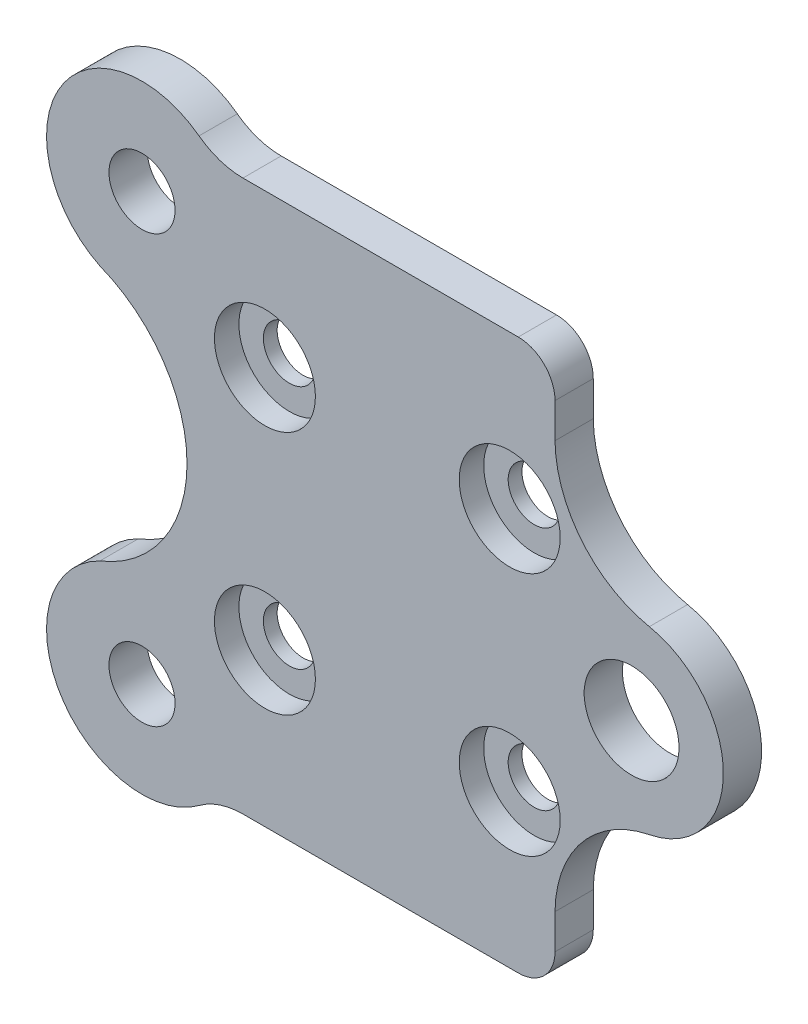
ISO-10303-21;
HEADER;
FILE_DESCRIPTION(('STEP AP214'),'2;1');
FILE_NAME('part.step','',(''),(''),'','','');
FILE_SCHEMA(('AUTOMOTIVE_DESIGN { 1 0 10303 214 1 1 1 1 }'));
ENDSEC;
DATA;
#1=APPLICATION_CONTEXT('core data for automotive mechanical design processes');
#2=APPLICATION_PROTOCOL_DEFINITION('international standard','automotive_design',2000,#1);
#3=PRODUCT_CONTEXT('',#1,'mechanical');
#4=PRODUCT('Part','Part','',(#3));
#5=PRODUCT_RELATED_PRODUCT_CATEGORY('part','',(#4));
#6=PRODUCT_DEFINITION_FORMATION('','',#4);
#7=PRODUCT_DEFINITION_CONTEXT('part definition',#1,'design');
#8=PRODUCT_DEFINITION('design','',#6,#7);
#9=PRODUCT_DEFINITION_SHAPE('','',#8);
#10=(LENGTH_UNIT() NAMED_UNIT(*) SI_UNIT(.MILLI.,.METRE.));
#11=(NAMED_UNIT(*) PLANE_ANGLE_UNIT() SI_UNIT($,.RADIAN.));
#12=(NAMED_UNIT(*) SI_UNIT($,.STERADIAN.) SOLID_ANGLE_UNIT());
#13=UNCERTAINTY_MEASURE_WITH_UNIT(LENGTH_MEASURE(1.E-05),#10,'distance_accuracy_value','');
#14=(GEOMETRIC_REPRESENTATION_CONTEXT(3) GLOBAL_UNCERTAINTY_ASSIGNED_CONTEXT((#13)) GLOBAL_UNIT_ASSIGNED_CONTEXT((#10,
#11,#12)) REPRESENTATION_CONTEXT('',''));
#15=CARTESIAN_POINT('',(0.,0.,0.));
#16=DIRECTION('',(0.,0.,1.));
#17=DIRECTION('',(1.,0.,0.));
#18=AXIS2_PLACEMENT_3D('',#15,#16,#17);
#19=CARTESIAN_POINT('',(82.0500548673,27.4305081809208,-3.125));
#20=DIRECTION('',(0.,0.,1.));
#21=DIRECTION('',(1.,0.,0.));
#22=AXIS2_PLACEMENT_3D('',#19,#20,#21);
#23=CYLINDRICAL_SURFACE('',#22,2.125);
#24=CARTESIAN_POINT('',(82.0500548673,27.4305081809208,-3.125));
#25=DIRECTION('',(0.,0.,1.));
#26=DIRECTION('',(1.,0.,0.));
#27=AXIS2_PLACEMENT_3D('',#24,#25,#26);
#28=CIRCLE('',#27,2.125);
#29=CARTESIAN_POINT('',(84.1750548673,27.4305081809208,-3.125));
#30=VERTEX_POINT('',#29);
#31=EDGE_CURVE('E620',#30,#30,#28,.T.);
#32=ORIENTED_EDGE('',*,*,#31,.F.);
#33=EDGE_LOOP('',(#32));
#34=FACE_BOUND('',#33,.T.);
#35=CARTESIAN_POINT('',(82.0500548673,27.4305081809208,-2.));
#36=DIRECTION('',(0.,0.,1.));
#37=DIRECTION('',(1.,0.,0.));
#38=AXIS2_PLACEMENT_3D('',#35,#36,#37);
#39=CIRCLE('',#38,2.125);
#40=CARTESIAN_POINT('',(84.1750548673,27.4305081809208,-2.));
#41=VERTEX_POINT('',#40);
#42=EDGE_CURVE('E441',#41,#41,#39,.F.);
#43=ORIENTED_EDGE('',*,*,#42,.F.);
#44=EDGE_LOOP('',(#43));
#45=FACE_BOUND('',#44,.T.);
#46=ADVANCED_FACE('F264',(#34,#45),#23,.F.);
#47=CARTESIAN_POINT('',(62.05010788,27.4305081809208,-3.125));
#48=DIRECTION('',(0.,0.,1.));
#49=DIRECTION('',(1.,0.,0.));
#50=AXIS2_PLACEMENT_3D('',#47,#48,#49);
#51=CYLINDRICAL_SURFACE('',#50,2.12500000000001);
#52=CARTESIAN_POINT('',(62.05010788,27.4305081809208,-3.125));
#53=DIRECTION('',(0.,0.,1.));
#54=DIRECTION('',(1.,0.,0.));
#55=AXIS2_PLACEMENT_3D('',#52,#53,#54);
#56=CIRCLE('',#55,2.12500000000001);
#57=CARTESIAN_POINT('',(64.17510788,27.4305081809208,-3.125));
#58=VERTEX_POINT('',#57);
#59=EDGE_CURVE('E623',#58,#58,#56,.T.);
#60=ORIENTED_EDGE('',*,*,#59,.F.);
#61=EDGE_LOOP('',(#60));
#62=FACE_BOUND('',#61,.T.);
#63=CARTESIAN_POINT('',(62.05010788,27.4305081809208,-2.));
#64=DIRECTION('',(0.,0.,1.));
#65=DIRECTION('',(1.,0.,0.));
#66=AXIS2_PLACEMENT_3D('',#63,#64,#65);
#67=CIRCLE('',#66,2.12500000000001);
#68=CARTESIAN_POINT('',(64.17510788,27.4305081809208,-2.));
#69=VERTEX_POINT('',#68);
#70=EDGE_CURVE('E662',#69,#69,#67,.T.);
#71=ORIENTED_EDGE('',*,*,#70,.T.);
#72=EDGE_LOOP('',(#71));
#73=FACE_BOUND('',#72,.T.);
#74=ADVANCED_FACE('F535',(#62,#73),#51,.F.);
#75=CARTESIAN_POINT('',(62.05010788,7.43050818092083,-3.125));
#76=DIRECTION('',(0.,0.,1.));
#77=DIRECTION('',(1.,0.,0.));
#78=AXIS2_PLACEMENT_3D('',#75,#76,#77);
#79=CYLINDRICAL_SURFACE('',#78,2.125);
#80=CARTESIAN_POINT('',(62.05010788,7.43050818092083,-3.125));
#81=DIRECTION('',(0.,0.,1.));
#82=DIRECTION('',(1.,0.,0.));
#83=AXIS2_PLACEMENT_3D('',#80,#81,#82);
#84=CIRCLE('',#83,2.125);
#85=CARTESIAN_POINT('',(64.17510788,7.43050818092083,-3.125));
#86=VERTEX_POINT('',#85);
#87=EDGE_CURVE('E608',#86,#86,#84,.T.);
#88=ORIENTED_EDGE('',*,*,#87,.F.);
#89=EDGE_LOOP('',(#88));
#90=FACE_BOUND('',#89,.T.);
#91=CARTESIAN_POINT('',(62.05010788,7.43050818092083,-2.));
#92=DIRECTION('',(0.,0.,1.));
#93=DIRECTION('',(1.,0.,0.));
#94=AXIS2_PLACEMENT_3D('',#91,#92,#93);
#95=CIRCLE('',#94,2.125);
#96=CARTESIAN_POINT('',(64.17510788,7.43050818092083,-2.));
#97=VERTEX_POINT('',#96);
#98=EDGE_CURVE('E614',#97,#97,#95,.T.);
#99=ORIENTED_EDGE('',*,*,#98,.T.);
#100=EDGE_LOOP('',(#99));
#101=FACE_BOUND('',#100,.T.);
#102=ADVANCED_FACE('F541',(#90,#101),#79,.F.);
#103=CARTESIAN_POINT('',(82.0500548673,7.43050818092083,-3.125));
#104=DIRECTION('',(0.,0.,1.));
#105=DIRECTION('',(1.,0.,0.));
#106=AXIS2_PLACEMENT_3D('',#103,#104,#105);
#107=CYLINDRICAL_SURFACE('',#106,2.125);
#108=CARTESIAN_POINT('',(82.0500548673,7.43050818092083,-3.125));
#109=DIRECTION('',(0.,0.,1.));
#110=DIRECTION('',(1.,0.,0.));
#111=AXIS2_PLACEMENT_3D('',#108,#109,#110);
#112=CIRCLE('',#111,2.125);
#113=CARTESIAN_POINT('',(84.1750548673,7.43050818092083,-3.125));
#114=VERTEX_POINT('',#113);
#115=EDGE_CURVE('E599',#114,#114,#112,.T.);
#116=ORIENTED_EDGE('',*,*,#115,.F.);
#117=EDGE_LOOP('',(#116));
#118=FACE_BOUND('',#117,.T.);
#119=CARTESIAN_POINT('',(82.0500548673,7.43050818092083,-2.));
#120=DIRECTION('',(0.,0.,1.));
#121=DIRECTION('',(1.,0.,0.));
#122=AXIS2_PLACEMENT_3D('',#119,#120,#121);
#123=CIRCLE('',#122,2.125);
#124=CARTESIAN_POINT('',(84.1750548673,7.43050818092083,-2.));
#125=VERTEX_POINT('',#124);
#126=EDGE_CURVE('E602',#125,#125,#123,.T.);
#127=ORIENTED_EDGE('',*,*,#126,.T.);
#128=EDGE_LOOP('',(#127));
#129=FACE_BOUND('',#128,.T.);
#130=ADVANCED_FACE('F547',(#118,#129),#107,.F.);
#131=CARTESIAN_POINT('',(52.0082075214231,-0.00478709079274138,-3.125));
#132=DIRECTION('',(0.,0.,1.));
#133=DIRECTION('',(1.,0.,0.));
#134=AXIS2_PLACEMENT_3D('',#131,#132,#133);
#135=CYLINDRICAL_SURFACE('',#134,7.80000000000975);
#136=CARTESIAN_POINT('',(52.0082075214231,-0.00478709079274138,-3.125));
#137=DIRECTION('',(0.,0.,1.));
#138=DIRECTION('',(1.,0.,0.));
#139=AXIS2_PLACEMENT_3D('',#136,#137,#138);
#140=CIRCLE('',#139,7.80000000000975);
#141=CARTESIAN_POINT('',(48.5735901579423,6.99831247772894,-3.125));
#142=VERTEX_POINT('',#141);
#143=CARTESIAN_POINT('',(56.6695313692701,-6.25875063287107,-3.125));
#144=VERTEX_POINT('',#143);
#145=EDGE_CURVE('E391',#142,#144,#140,.T.);
#146=ORIENTED_EDGE('',*,*,#145,.T.);
#147=DIRECTION('',(0.,0.,1.));
#148=VECTOR('',#147,1.);
#149=CARTESIAN_POINT('',(56.6695313692701,-6.25875063287107,-3.125));
#150=LINE('',#149,#148);
#151=CARTESIAN_POINT('',(56.6695313692701,-6.25875063287107,0.));
#152=VERTEX_POINT('',#151);
#153=EDGE_CURVE('E469',#144,#152,#150,.T.);
#154=ORIENTED_EDGE('',*,*,#153,.T.);
#155=CARTESIAN_POINT('',(52.0082075214231,-0.00478709079274138,0.));
#156=DIRECTION('',(0.,0.,1.));
#157=DIRECTION('',(1.,0.,0.));
#158=AXIS2_PLACEMENT_3D('',#155,#156,#157);
#159=CIRCLE('',#158,7.80000000000975);
#160=CARTESIAN_POINT('',(48.5735901579423,6.99831247772894,0.));
#161=VERTEX_POINT('',#160);
#162=EDGE_CURVE('E406',#161,#152,#159,.T.);
#163=ORIENTED_EDGE('',*,*,#162,.F.);
#164=DIRECTION('',(0.,0.,1.));
#165=VECTOR('',#164,1.);
#166=CARTESIAN_POINT('',(48.5735901579423,6.99831247772894,-3.125));
#167=LINE('',#166,#165);
#168=EDGE_CURVE('E429',#142,#161,#167,.T.);
#169=ORIENTED_EDGE('',*,*,#168,.F.);
#170=EDGE_LOOP('',(#146,#154,#163,#169));
#171=FACE_BOUND('',#170,.T.);
#172=ADVANCED_FACE('F501',(#171),#135,.T.);
#173=CARTESIAN_POINT('',(44.4800195239708,17.4305081809208,-3.125));
#174=DIRECTION('',(0.,0.,1.));
#175=DIRECTION('',(1.,0.,0.));
#176=AXIS2_PLACEMENT_3D('',#173,#174,#175);
#177=CYLINDRICAL_SURFACE('',#176,11.2066064321457);
#178=CARTESIAN_POINT('',(44.4800195239708,17.4305081809208,0.));
#179=DIRECTION('',(0.,0.,1.));
#180=DIRECTION('',(1.,0.,0.));
#181=AXIS2_PLACEMENT_3D('',#178,#179,#180);
#182=CIRCLE('',#181,11.2066064321457);
#183=CARTESIAN_POINT('',(48.5735901579423,27.8627038841127,0.));
#184=VERTEX_POINT('',#183);
#185=EDGE_CURVE('E427',#161,#184,#182,.T.);
#186=ORIENTED_EDGE('',*,*,#185,.T.);
#187=DIRECTION('',(0.,0.,1.));
#188=VECTOR('',#187,1.);
#189=CARTESIAN_POINT('',(48.5735901579423,27.8627038841127,-3.125));
#190=LINE('',#189,#188);
#191=CARTESIAN_POINT('',(48.5735901579423,27.8627038841127,-3.125));
#192=VERTEX_POINT('',#191);
#193=EDGE_CURVE('E432',#192,#184,#190,.T.);
#194=ORIENTED_EDGE('',*,*,#193,.F.);
#195=CARTESIAN_POINT('',(44.4800195239708,17.4305081809208,-3.125));
#196=DIRECTION('',(0.,0.,1.));
#197=DIRECTION('',(1.,0.,0.));
#198=AXIS2_PLACEMENT_3D('',#195,#196,#197);
#199=CIRCLE('',#198,11.2066064321457);
#200=EDGE_CURVE('E384',#142,#192,#199,.T.);
#201=ORIENTED_EDGE('',*,*,#200,.F.);
#202=ORIENTED_EDGE('',*,*,#168,.T.);
#203=EDGE_LOOP('',(#186,#194,#201,#202));
#204=FACE_BOUND('',#203,.T.);
#205=ADVANCED_FACE('F496',(#204),#177,.F.);
#206=CARTESIAN_POINT('',(52.0082075214231,34.8658034526344,-3.125));
#207=DIRECTION('',(0.,0.,1.));
#208=DIRECTION('',(1.,0.,0.));
#209=AXIS2_PLACEMENT_3D('',#206,#207,#208);
#210=CYLINDRICAL_SURFACE('',#209,7.80000000000975);
#211=CARTESIAN_POINT('',(52.0082075214231,34.8658034526344,0.));
#212=DIRECTION('',(0.,0.,-1.));
#213=DIRECTION('',(-1.,0.,0.));
#214=AXIS2_PLACEMENT_3D('',#211,#212,#213);
#215=CIRCLE('',#214,7.80000000000975);
#216=CARTESIAN_POINT('',(56.6695313692701,41.1197669947127,0.));
#217=VERTEX_POINT('',#216);
#218=EDGE_CURVE('E424',#184,#217,#215,.T.);
#219=ORIENTED_EDGE('',*,*,#218,.T.);
#220=DIRECTION('',(0.,0.,1.));
#221=VECTOR('',#220,1.);
#222=CARTESIAN_POINT('',(56.6695313692701,41.1197669947127,-3.125));
#223=LINE('',#222,#221);
#224=CARTESIAN_POINT('',(56.6695313692701,41.1197669947127,-3.125));
#225=VERTEX_POINT('',#224);
#226=EDGE_CURVE('E467',#217,#225,#223,.F.);
#227=ORIENTED_EDGE('',*,*,#226,.T.);
#228=CARTESIAN_POINT('',(52.0082075214231,34.8658034526344,-3.125));
#229=DIRECTION('',(0.,0.,-1.));
#230=DIRECTION('',(-1.,0.,0.));
#231=AXIS2_PLACEMENT_3D('',#228,#229,#230);
#232=CIRCLE('',#231,7.80000000000975);
#233=EDGE_CURVE('E402',#192,#225,#232,.T.);
#234=ORIENTED_EDGE('',*,*,#233,.F.);
#235=ORIENTED_EDGE('',*,*,#193,.T.);
#236=EDGE_LOOP('',(#219,#227,#234,#235));
#237=FACE_BOUND('',#236,.T.);
#238=ADVANCED_FACE('F492',(#237),#210,.T.);
#239=CARTESIAN_POINT('',(57.940219491693,39.9305081809208,-3.125));
#240=DIRECTION('',(0.,-1.,0.));
#241=DIRECTION('',(0.,0.,-1.));
#242=AXIS2_PLACEMENT_3D('',#239,#240,#241);
#243=PLANE('',#242);
#244=DIRECTION('',(1.,0.,0.));
#245=VECTOR('',#244,1.);
#246=CARTESIAN_POINT('',(57.940219491693,39.9305081809208,-3.125));
#247=LINE('',#246,#245);
#248=CARTESIAN_POINT('',(60.2551650983787,39.9305081809208,-3.125));
#249=VERTEX_POINT('',#248);
#250=CARTESIAN_POINT('',(82.7511654582989,39.9305081809208,-3.125));
#251=VERTEX_POINT('',#250);
#252=EDGE_CURVE('E400',#249,#251,#247,.T.);
#253=ORIENTED_EDGE('',*,*,#252,.F.);
#254=DIRECTION('',(0.,0.,-1.));
#255=VECTOR('',#254,1.);
#256=CARTESIAN_POINT('',(60.2551650983787,39.9305081809208,0.));
#257=LINE('',#256,#255);
#258=CARTESIAN_POINT('',(60.2551650983787,39.9305081809208,0.));
#259=VERTEX_POINT('',#258);
#260=EDGE_CURVE('E464',#249,#259,#257,.F.);
#261=ORIENTED_EDGE('',*,*,#260,.T.);
#262=DIRECTION('',(1.,0.,0.));
#263=VECTOR('',#262,1.);
#264=CARTESIAN_POINT('',(57.940219491693,39.9305081809208,0.));
#265=LINE('',#264,#263);
#266=CARTESIAN_POINT('',(82.7511654582989,39.9305081809208,0.));
#267=VERTEX_POINT('',#266);
#268=EDGE_CURVE('E422',#259,#267,#265,.T.);
#269=ORIENTED_EDGE('',*,*,#268,.T.);
#270=DIRECTION('',(0.,0.,1.));
#271=VECTOR('',#270,1.);
#272=CARTESIAN_POINT('',(82.7511654582989,39.9305081809208,-3.125));
#273=LINE('',#272,#271);
#274=EDGE_CURVE('E461',#267,#251,#273,.F.);
#275=ORIENTED_EDGE('',*,*,#274,.T.);
#276=EDGE_LOOP('',(#253,#261,#269,#275));
#277=FACE_BOUND('',#276,.T.);
#278=ADVANCED_FACE('F483',(#277),#243,.F.);
#279=CARTESIAN_POINT('',(85.7511654582989,39.9305081809208,-3.125));
#280=DIRECTION('',(-1.,0.,0.));
#281=DIRECTION('',(0.,-1.,0.));
#282=AXIS2_PLACEMENT_3D('',#279,#280,#281);
#283=PLANE('',#282);
#284=DIRECTION('',(0.,-1.,0.));
#285=VECTOR('',#284,1.);
#286=CARTESIAN_POINT('',(85.7511654582989,39.9305081809208,-3.125));
#287=LINE('',#286,#285);
#288=CARTESIAN_POINT('',(85.7511654582989,36.9305081809208,-3.125));
#289=VERTEX_POINT('',#288);
#290=CARTESIAN_POINT('',(85.7511654582988,34.0911124146329,-3.125));
#291=VERTEX_POINT('',#290);
#292=EDGE_CURVE('E398',#289,#291,#287,.T.);
#293=ORIENTED_EDGE('',*,*,#292,.F.);
#294=DIRECTION('',(0.,0.,1.));
#295=VECTOR('',#294,1.);
#296=CARTESIAN_POINT('',(85.7511654582989,36.9305081809208,-3.125));
#297=LINE('',#296,#295);
#298=CARTESIAN_POINT('',(85.7511654582989,36.9305081809208,0.));
#299=VERTEX_POINT('',#298);
#300=EDGE_CURVE('E458',#289,#299,#297,.T.);
#301=ORIENTED_EDGE('',*,*,#300,.T.);
#302=DIRECTION('',(0.,-1.,0.));
#303=VECTOR('',#302,1.);
#304=CARTESIAN_POINT('',(85.7511654582989,39.9305081809208,0.));
#305=LINE('',#304,#303);
#306=CARTESIAN_POINT('',(85.7511654582988,34.0911124146329,0.));
#307=VERTEX_POINT('',#306);
#308=EDGE_CURVE('E420',#299,#307,#305,.T.);
#309=ORIENTED_EDGE('',*,*,#308,.T.);
#310=DIRECTION('',(0.,0.,1.));
#311=VECTOR('',#310,1.);
#312=CARTESIAN_POINT('',(85.7511654582988,34.0911124146329,-3.125));
#313=LINE('',#312,#311);
#314=EDGE_CURVE('E435',#291,#307,#313,.T.);
#315=ORIENTED_EDGE('',*,*,#314,.F.);
#316=EDGE_LOOP('',(#293,#301,#309,#315));
#317=FACE_BOUND('',#316,.T.);
#318=ADVANCED_FACE('F522',(#317),#283,.F.);
#319=CARTESIAN_POINT('',(95.3555620860846,34.2048076301968,-3.125));
#320=DIRECTION('',(0.,0.,1.));
#321=DIRECTION('',(1.,0.,0.));
#322=AXIS2_PLACEMENT_3D('',#319,#320,#321);
#323=CYLINDRICAL_SURFACE('',#322,9.60506955653446);
#324=CARTESIAN_POINT('',(95.3555620860846,34.2048076301968,0.));
#325=DIRECTION('',(0.,0.,1.));
#326=DIRECTION('',(1.,0.,0.));
#327=AXIS2_PLACEMENT_3D('',#324,#325,#326);
#328=CIRCLE('',#327,9.60506955653446);
#329=CARTESIAN_POINT('',(93.4574363423077,24.7891568376772,0.));
#330=VERTEX_POINT('',#329);
#331=EDGE_CURVE('E417',#307,#330,#328,.T.);
#332=ORIENTED_EDGE('',*,*,#331,.T.);
#333=DIRECTION('',(0.,0.,1.));
#334=VECTOR('',#333,1.);
#335=CARTESIAN_POINT('',(93.4574363423077,24.7891568376772,-3.125));
#336=LINE('',#335,#334);
#337=CARTESIAN_POINT('',(93.4574363423077,24.7891568376772,-3.125));
#338=VERTEX_POINT('',#337);
#339=EDGE_CURVE('E438',#338,#330,#336,.T.);
#340=ORIENTED_EDGE('',*,*,#339,.F.);
#341=CARTESIAN_POINT('',(95.3555620860846,34.2048076301968,-3.125));
#342=DIRECTION('',(0.,0.,1.));
#343=DIRECTION('',(1.,0.,0.));
#344=AXIS2_PLACEMENT_3D('',#341,#342,#343);
#345=CIRCLE('',#344,9.60506955653446);
#346=EDGE_CURVE('E396',#291,#338,#345,.T.);
#347=ORIENTED_EDGE('',*,*,#346,.F.);
#348=ORIENTED_EDGE('',*,*,#314,.T.);
#349=EDGE_LOOP('',(#332,#340,#347,#348));
#350=FACE_BOUND('',#349,.T.);
#351=ADVANCED_FACE('F517',(#350),#323,.F.);
#352=CARTESIAN_POINT('',(92.0081986301231,17.4305081809208,-3.125));
#353=DIRECTION('',(0.,0.,1.));
#354=DIRECTION('',(1.,0.,0.));
#355=AXIS2_PLACEMENT_3D('',#352,#353,#354);
#356=CYLINDRICAL_SURFACE('',#355,7.49999999999999);
#357=CARTESIAN_POINT('',(92.0081986301231,17.4305081809208,0.));
#358=DIRECTION('',(0.,0.,1.));
#359=DIRECTION('',(1.,0.,0.));
#360=AXIS2_PLACEMENT_3D('',#357,#358,#359);
#361=CIRCLE('',#360,7.49999999999999);
#362=CARTESIAN_POINT('',(93.4574363423077,10.0718595241645,0.));
#363=VERTEX_POINT('',#362);
#364=EDGE_CURVE('E414',#363,#330,#361,.T.);
#365=ORIENTED_EDGE('',*,*,#364,.F.);
#366=DIRECTION('',(0.,0.,1.));
#367=VECTOR('',#366,1.);
#368=CARTESIAN_POINT('',(93.4574363423077,10.0718595241645,-3.125));
#369=LINE('',#368,#367);
#370=CARTESIAN_POINT('',(93.4574363423077,10.0718595241645,-3.125));
#371=VERTEX_POINT('',#370);
#372=EDGE_CURVE('E383',#371,#363,#369,.T.);
#373=ORIENTED_EDGE('',*,*,#372,.F.);
#374=CARTESIAN_POINT('',(92.0081986301231,17.4305081809208,-3.125));
#375=DIRECTION('',(0.,0.,1.));
#376=DIRECTION('',(1.,0.,0.));
#377=AXIS2_PLACEMENT_3D('',#374,#375,#376);
#378=CIRCLE('',#377,7.49999999999999);
#379=EDGE_CURVE('E372',#371,#338,#378,.T.);
#380=ORIENTED_EDGE('',*,*,#379,.T.);
#381=ORIENTED_EDGE('',*,*,#339,.T.);
#382=EDGE_LOOP('',(#365,#373,#380,#381));
#383=FACE_BOUND('',#382,.T.);
#384=ADVANCED_FACE('F513',(#383),#356,.T.);
#385=CARTESIAN_POINT('',(95.3555620860846,0.656208731644823,-3.125));
#386=DIRECTION('',(0.,0.,1.));
#387=DIRECTION('',(1.,0.,0.));
#388=AXIS2_PLACEMENT_3D('',#385,#386,#387);
#389=CYLINDRICAL_SURFACE('',#388,9.60506955653445);
#390=CARTESIAN_POINT('',(95.3555620860846,0.656208731644823,0.));
#391=DIRECTION('',(0.,0.,1.));
#392=DIRECTION('',(1.,0.,0.));
#393=AXIS2_PLACEMENT_3D('',#390,#391,#392);
#394=CIRCLE('',#393,9.60506955653445);
#395=CARTESIAN_POINT('',(85.7511654582988,0.769903947208809,0.));
#396=VERTEX_POINT('',#395);
#397=EDGE_CURVE('E379',#363,#396,#394,.T.);
#398=ORIENTED_EDGE('',*,*,#397,.T.);
#399=DIRECTION('',(0.,0.,1.));
#400=VECTOR('',#399,1.);
#401=CARTESIAN_POINT('',(85.7511654582988,0.769903947208809,-3.125));
#402=LINE('',#401,#400);
#403=CARTESIAN_POINT('',(85.7511654582988,0.769903947208809,-3.125));
#404=VERTEX_POINT('',#403);
#405=EDGE_CURVE('E376',#404,#396,#402,.T.);
#406=ORIENTED_EDGE('',*,*,#405,.F.);
#407=CARTESIAN_POINT('',(95.3555620860846,0.656208731644823,-3.125));
#408=DIRECTION('',(0.,0.,1.));
#409=DIRECTION('',(1.,0.,0.));
#410=AXIS2_PLACEMENT_3D('',#407,#408,#409);
#411=CIRCLE('',#410,9.60506955653445);
#412=EDGE_CURVE('E364',#371,#404,#411,.T.);
#413=ORIENTED_EDGE('',*,*,#412,.F.);
#414=ORIENTED_EDGE('',*,*,#372,.T.);
#415=EDGE_LOOP('',(#398,#406,#413,#414));
#416=FACE_BOUND('',#415,.T.);
#417=ADVANCED_FACE('F377',(#416),#389,.F.);
#418=CARTESIAN_POINT('',(85.7511654582988,0.769903947208809,-3.125));
#419=DIRECTION('',(-1.,0.,0.));
#420=DIRECTION('',(0.,-1.,0.));
#421=AXIS2_PLACEMENT_3D('',#418,#419,#420);
#422=PLANE('',#421);
#423=DIRECTION('',(0.,-1.,0.));
#424=VECTOR('',#423,1.);
#425=CARTESIAN_POINT('',(85.7511654582988,0.769903947208809,0.));
#426=LINE('',#425,#424);
#427=CARTESIAN_POINT('',(85.7511654582989,-2.06949181907912,0.));
#428=VERTEX_POINT('',#427);
#429=EDGE_CURVE('E411',#396,#428,#426,.T.);
#430=ORIENTED_EDGE('',*,*,#429,.T.);
#431=DIRECTION('',(0.,0.,1.));
#432=VECTOR('',#431,1.);
#433=CARTESIAN_POINT('',(85.7511654582989,-2.06949181907912,-3.125));
#434=LINE('',#433,#432);
#435=CARTESIAN_POINT('',(85.7511654582989,-2.06949181907912,-3.125));
#436=VERTEX_POINT('',#435);
#437=EDGE_CURVE('E388',#428,#436,#434,.F.);
#438=ORIENTED_EDGE('',*,*,#437,.T.);
#439=DIRECTION('',(0.,-1.,0.));
#440=VECTOR('',#439,1.);
#441=CARTESIAN_POINT('',(85.7511654582988,0.769903947208809,-3.125));
#442=LINE('',#441,#440);
#443=EDGE_CURVE('E369',#404,#436,#442,.T.);
#444=ORIENTED_EDGE('',*,*,#443,.F.);
#445=ORIENTED_EDGE('',*,*,#405,.T.);
#446=EDGE_LOOP('',(#430,#438,#444,#445));
#447=FACE_BOUND('',#446,.T.);
#448=ADVANCED_FACE('F386',(#447),#422,.F.);
#449=CARTESIAN_POINT('',(57.940219491693,-5.06949181907916,-3.125));
#450=DIRECTION('',(0.,-1.,0.));
#451=DIRECTION('',(1.,0.,0.));
#452=AXIS2_PLACEMENT_3D('',#449,#450,#451);
#453=PLANE('',#452);
#454=DIRECTION('',(1.,0.,0.));
#455=VECTOR('',#454,1.);
#456=CARTESIAN_POINT('',(57.940219491693,-5.06949181907916,0.));
#457=LINE('',#456,#455);
#458=CARTESIAN_POINT('',(60.2551650983787,-5.06949181907916,0.));
#459=VERTEX_POINT('',#458);
#460=CARTESIAN_POINT('',(82.7511654582989,-5.06949181907915,0.));
#461=VERTEX_POINT('',#460);
#462=EDGE_CURVE('E408',#459,#461,#457,.T.);
#463=ORIENTED_EDGE('',*,*,#462,.F.);
#464=DIRECTION('',(0.,0.,-1.));
#465=VECTOR('',#464,1.);
#466=CARTESIAN_POINT('',(60.2551650983787,-5.06949181907916,-3.125));
#467=LINE('',#466,#465);
#468=CARTESIAN_POINT('',(60.2551650983787,-5.06949181907916,-3.125));
#469=VERTEX_POINT('',#468);
#470=EDGE_CURVE('E285',#459,#469,#467,.T.);
#471=ORIENTED_EDGE('',*,*,#470,.T.);
#472=DIRECTION('',(1.,0.,0.));
#473=VECTOR('',#472,1.);
#474=CARTESIAN_POINT('',(57.940219491693,-5.06949181907916,-3.125));
#475=LINE('',#474,#473);
#476=CARTESIAN_POINT('',(82.7511654582989,-5.06949181907915,-3.125));
#477=VERTEX_POINT('',#476);
#478=EDGE_CURVE('E389',#469,#477,#475,.T.);
#479=ORIENTED_EDGE('',*,*,#478,.T.);
#480=DIRECTION('',(0.,0.,1.));
#481=VECTOR('',#480,1.);
#482=CARTESIAN_POINT('',(82.7511654582989,-5.06949181907915,0.));
#483=LINE('',#482,#481);
#484=EDGE_CURVE('E431',#477,#461,#483,.T.);
#485=ORIENTED_EDGE('',*,*,#484,.T.);
#486=EDGE_LOOP('',(#463,#471,#479,#485));
#487=FACE_BOUND('',#486,.T.);
#488=ADVANCED_FACE('F506',(#487),#453,.T.);
#489=CARTESIAN_POINT('',(52.0082075214231,-0.00478709079274138,-3.125));
#490=DIRECTION('',(0.,0.,1.));
#491=DIRECTION('',(1.,0.,0.));
#492=AXIS2_PLACEMENT_3D('',#489,#490,#491);
#493=PLANE('',#492);
#494=ORIENTED_EDGE('',*,*,#87,.T.);
#495=EDGE_LOOP('',(#494));
#496=FACE_BOUND('',#495,.T.);
#497=ORIENTED_EDGE('',*,*,#115,.T.);
#498=EDGE_LOOP('',(#497));
#499=FACE_BOUND('',#498,.T.);
#500=ORIENTED_EDGE('',*,*,#31,.T.);
#501=EDGE_LOOP('',(#500));
#502=FACE_BOUND('',#501,.T.);
#503=ORIENTED_EDGE('',*,*,#59,.T.);
#504=EDGE_LOOP('',(#503));
#505=FACE_BOUND('',#504,.T.);
#506=CARTESIAN_POINT('',(92.0081986301231,17.4305081809208,-3.125));
#507=DIRECTION('',(0.,0.,1.));
#508=DIRECTION('',(1.,0.,0.));
#509=AXIS2_PLACEMENT_3D('',#506,#507,#508);
#510=CIRCLE('',#509,3.875);
#511=CARTESIAN_POINT('',(95.8831986301231,17.4305081809208,-3.125));
#512=VERTEX_POINT('',#511);
#513=EDGE_CURVE('E627',#512,#512,#510,.T.);
#514=ORIENTED_EDGE('',*,*,#513,.T.);
#515=EDGE_LOOP('',(#514));
#516=FACE_BOUND('',#515,.T.);
#517=CARTESIAN_POINT('',(52.0082075214231,-0.00478709079274138,-3.125));
#518=DIRECTION('',(0.,0.,1.));
#519=DIRECTION('',(1.,0.,0.));
#520=AXIS2_PLACEMENT_3D('',#517,#518,#519);
#521=CIRCLE('',#520,2.7);
#522=CARTESIAN_POINT('',(54.7082075214231,-0.00478709079274138,-3.125));
#523=VERTEX_POINT('',#522);
#524=EDGE_CURVE('E633',#523,#523,#521,.T.);
#525=ORIENTED_EDGE('',*,*,#524,.T.);
#526=EDGE_LOOP('',(#525));
#527=FACE_BOUND('',#526,.T.);
#528=CARTESIAN_POINT('',(52.0082075214231,34.8658034526344,-3.125));
#529=DIRECTION('',(0.,0.,1.));
#530=DIRECTION('',(1.,0.,0.));
#531=AXIS2_PLACEMENT_3D('',#528,#529,#530);
#532=CIRCLE('',#531,2.70000000000001);
#533=CARTESIAN_POINT('',(54.7082075214231,34.8658034526344,-3.125));
#534=VERTEX_POINT('',#533);
#535=EDGE_CURVE('E409',#534,#534,#532,.T.);
#536=ORIENTED_EDGE('',*,*,#535,.T.);
#537=EDGE_LOOP('',(#536));
#538=FACE_BOUND('',#537,.T.);
#539=ORIENTED_EDGE('',*,*,#443,.T.);
#540=CARTESIAN_POINT('',(82.7511654582989,-2.06949181907915,-3.125));
#541=DIRECTION('',(0.,0.,1.));
#542=DIRECTION('',(1.,0.,0.));
#543=AXIS2_PLACEMENT_3D('',#540,#541,#542);
#544=CIRCLE('',#543,3.);
#545=EDGE_CURVE('E456',#436,#477,#544,.F.);
#546=ORIENTED_EDGE('',*,*,#545,.T.);
#547=ORIENTED_EDGE('',*,*,#478,.F.);
#548=CARTESIAN_POINT('',(60.2551650983787,-11.0694918190792,-3.125));
#549=DIRECTION('',(0.,0.,1.));
#550=DIRECTION('',(1.,0.,0.));
#551=AXIS2_PLACEMENT_3D('',#548,#549,#550);
#552=CIRCLE('',#551,6.);
#553=EDGE_CURVE('E12',#469,#144,#552,.T.);
#554=ORIENTED_EDGE('',*,*,#553,.T.);
#555=ORIENTED_EDGE('',*,*,#145,.F.);
#556=ORIENTED_EDGE('',*,*,#200,.T.);
#557=ORIENTED_EDGE('',*,*,#233,.T.);
#558=CARTESIAN_POINT('',(60.2551650983787,45.9305081809208,-3.125));
#559=DIRECTION('',(0.,0.,1.));
#560=DIRECTION('',(1.,0.,0.));
#561=AXIS2_PLACEMENT_3D('',#558,#559,#560);
#562=CIRCLE('',#561,6.);
#563=EDGE_CURVE('E475',#225,#249,#562,.T.);
#564=ORIENTED_EDGE('',*,*,#563,.T.);
#565=ORIENTED_EDGE('',*,*,#252,.T.);
#566=CARTESIAN_POINT('',(82.7511654582989,36.9305081809208,-3.125));
#567=DIRECTION('',(0.,0.,1.));
#568=DIRECTION('',(1.,0.,0.));
#569=AXIS2_PLACEMENT_3D('',#566,#567,#568);
#570=CIRCLE('',#569,3.);
#571=EDGE_CURVE('E454',#251,#289,#570,.F.);
#572=ORIENTED_EDGE('',*,*,#571,.T.);
#573=ORIENTED_EDGE('',*,*,#292,.T.);
#574=ORIENTED_EDGE('',*,*,#346,.T.);
#575=ORIENTED_EDGE('',*,*,#379,.F.);
#576=ORIENTED_EDGE('',*,*,#412,.T.);
#577=EDGE_LOOP('',(#539,#546,#547,#554,#555,#556,#557,#564,#565,#572,#573,#574,#575,#576));
#578=FACE_BOUND('',#577,.T.);
#579=ADVANCED_FACE('F366',(#496,#499,#502,#505,#516,#527,#538,#578),#493,.F.);
#580=CARTESIAN_POINT('',(52.0082075214231,-0.00478709079274138,0.));
#581=DIRECTION('',(0.,0.,1.));
#582=DIRECTION('',(1.,0.,0.));
#583=AXIS2_PLACEMENT_3D('',#580,#581,#582);
#584=PLANE('',#583);
#585=CARTESIAN_POINT('',(82.0500548673,27.4305081809208,0.));
#586=DIRECTION('',(0.,0.,1.));
#587=DIRECTION('',(1.,0.,0.));
#588=AXIS2_PLACEMENT_3D('',#585,#586,#587);
#589=CIRCLE('',#588,4.125);
#590=CARTESIAN_POINT('',(86.1750548673,27.4305081809208,0.));
#591=VERTEX_POINT('',#590);
#592=EDGE_CURVE('E445',#591,#591,#589,.T.);
#593=ORIENTED_EDGE('',*,*,#592,.F.);
#594=EDGE_LOOP('',(#593));
#595=FACE_BOUND('',#594,.T.);
#596=CARTESIAN_POINT('',(62.05010788,27.4305081809208,0.));
#597=DIRECTION('',(0.,0.,1.));
#598=DIRECTION('',(1.,0.,0.));
#599=AXIS2_PLACEMENT_3D('',#596,#597,#598);
#600=CIRCLE('',#599,4.12500000000001);
#601=CARTESIAN_POINT('',(66.17510788,27.4305081809208,0.));
#602=VERTEX_POINT('',#601);
#603=EDGE_CURVE('E664',#602,#602,#600,.T.);
#604=ORIENTED_EDGE('',*,*,#603,.F.);
#605=EDGE_LOOP('',(#604));
#606=FACE_BOUND('',#605,.T.);
#607=CARTESIAN_POINT('',(62.05010788,7.43050818092083,0.));
#608=DIRECTION('',(0.,0.,1.));
#609=DIRECTION('',(1.,0.,0.));
#610=AXIS2_PLACEMENT_3D('',#607,#608,#609);
#611=CIRCLE('',#610,4.12499999999999);
#612=CARTESIAN_POINT('',(66.17510788,7.43050818092083,0.));
#613=VERTEX_POINT('',#612);
#614=EDGE_CURVE('E611',#613,#613,#611,.T.);
#615=ORIENTED_EDGE('',*,*,#614,.F.);
#616=EDGE_LOOP('',(#615));
#617=FACE_BOUND('',#616,.T.);
#618=CARTESIAN_POINT('',(82.0500548673,7.43050818092083,0.));
#619=DIRECTION('',(0.,0.,1.));
#620=DIRECTION('',(1.,0.,0.));
#621=AXIS2_PLACEMENT_3D('',#618,#619,#620);
#622=CIRCLE('',#621,4.125);
#623=CARTESIAN_POINT('',(86.1750548673,7.43050818092083,0.));
#624=VERTEX_POINT('',#623);
#625=EDGE_CURVE('E605',#624,#624,#622,.T.);
#626=ORIENTED_EDGE('',*,*,#625,.F.);
#627=EDGE_LOOP('',(#626));
#628=FACE_BOUND('',#627,.T.);
#629=CARTESIAN_POINT('',(92.0081986301231,17.4305081809208,0.));
#630=DIRECTION('',(0.,0.,1.));
#631=DIRECTION('',(1.,0.,0.));
#632=AXIS2_PLACEMENT_3D('',#629,#630,#631);
#633=CIRCLE('',#632,3.875);
#634=CARTESIAN_POINT('',(95.8831986301231,17.4305081809208,0.));
#635=VERTEX_POINT('',#634);
#636=EDGE_CURVE('E626',#635,#635,#633,.T.);
#637=ORIENTED_EDGE('',*,*,#636,.F.);
#638=EDGE_LOOP('',(#637));
#639=FACE_BOUND('',#638,.T.);
#640=CARTESIAN_POINT('',(52.0082075214231,-0.00478709079274138,0.));
#641=DIRECTION('',(0.,0.,1.));
#642=DIRECTION('',(1.,0.,0.));
#643=AXIS2_PLACEMENT_3D('',#640,#641,#642);
#644=CIRCLE('',#643,2.7);
#645=CARTESIAN_POINT('',(54.7082075214231,-0.00478709079274138,0.));
#646=VERTEX_POINT('',#645);
#647=EDGE_CURVE('E630',#646,#646,#644,.T.);
#648=ORIENTED_EDGE('',*,*,#647,.F.);
#649=EDGE_LOOP('',(#648));
#650=FACE_BOUND('',#649,.T.);
#651=CARTESIAN_POINT('',(52.0082075214231,34.8658034526344,0.));
#652=DIRECTION('',(0.,0.,1.));
#653=DIRECTION('',(1.,0.,0.));
#654=AXIS2_PLACEMENT_3D('',#651,#652,#653);
#655=CIRCLE('',#654,2.70000000000001);
#656=CARTESIAN_POINT('',(54.7082075214231,34.8658034526344,0.));
#657=VERTEX_POINT('',#656);
#658=EDGE_CURVE('E636',#657,#657,#655,.T.);
#659=ORIENTED_EDGE('',*,*,#658,.F.);
#660=EDGE_LOOP('',(#659));
#661=FACE_BOUND('',#660,.T.);
#662=ORIENTED_EDGE('',*,*,#162,.T.);
#663=CARTESIAN_POINT('',(60.2551650983787,-11.0694918190792,0.));
#664=DIRECTION('',(0.,0.,1.));
#665=DIRECTION('',(1.,0.,0.));
#666=AXIS2_PLACEMENT_3D('',#663,#664,#665);
#667=CIRCLE('',#666,6.);
#668=EDGE_CURVE('E272',#152,#459,#667,.F.);
#669=ORIENTED_EDGE('',*,*,#668,.T.);
#670=ORIENTED_EDGE('',*,*,#462,.T.);
#671=CARTESIAN_POINT('',(82.7511654582989,-2.06949181907915,0.));
#672=DIRECTION('',(0.,0.,1.));
#673=DIRECTION('',(1.,0.,0.));
#674=AXIS2_PLACEMENT_3D('',#671,#672,#673);
#675=CIRCLE('',#674,3.);
#676=EDGE_CURVE('E451',#461,#428,#675,.T.);
#677=ORIENTED_EDGE('',*,*,#676,.T.);
#678=ORIENTED_EDGE('',*,*,#429,.F.);
#679=ORIENTED_EDGE('',*,*,#397,.F.);
#680=ORIENTED_EDGE('',*,*,#364,.T.);
#681=ORIENTED_EDGE('',*,*,#331,.F.);
#682=ORIENTED_EDGE('',*,*,#308,.F.);
#683=CARTESIAN_POINT('',(82.7511654582989,36.9305081809208,0.));
#684=DIRECTION('',(0.,0.,1.));
#685=DIRECTION('',(1.,0.,0.));
#686=AXIS2_PLACEMENT_3D('',#683,#684,#685);
#687=CIRCLE('',#686,3.);
#688=EDGE_CURVE('E448',#299,#267,#687,.T.);
#689=ORIENTED_EDGE('',*,*,#688,.T.);
#690=ORIENTED_EDGE('',*,*,#268,.F.);
#691=CARTESIAN_POINT('',(60.2551650983787,45.9305081809208,0.));
#692=DIRECTION('',(0.,0.,1.));
#693=DIRECTION('',(1.,0.,0.));
#694=AXIS2_PLACEMENT_3D('',#691,#692,#693);
#695=CIRCLE('',#694,6.);
#696=EDGE_CURVE('E473',#259,#217,#695,.F.);
#697=ORIENTED_EDGE('',*,*,#696,.T.);
#698=ORIENTED_EDGE('',*,*,#218,.F.);
#699=ORIENTED_EDGE('',*,*,#185,.F.);
#700=EDGE_LOOP('',(#662,#669,#670,#677,#678,#679,#680,#681,#682,#689,#690,#697,#698,#699));
#701=FACE_BOUND('',#700,.T.);
#702=ADVANCED_FACE('F489',(#595,#606,#617,#628,#639,#650,#661,#701),#584,.T.);
#703=CARTESIAN_POINT('',(52.0082075214231,34.8658034526344,-3.125));
#704=DIRECTION('',(0.,0.,1.));
#705=DIRECTION('',(1.,0.,0.));
#706=AXIS2_PLACEMENT_3D('',#703,#704,#705);
#707=CYLINDRICAL_SURFACE('',#706,2.70000000000001);
#708=ORIENTED_EDGE('',*,*,#535,.F.);
#709=EDGE_LOOP('',(#708));
#710=FACE_BOUND('',#709,.T.);
#711=ORIENTED_EDGE('',*,*,#658,.T.);
#712=EDGE_LOOP('',(#711));
#713=FACE_BOUND('',#712,.T.);
#714=ADVANCED_FACE('F558',(#710,#713),#707,.F.);
#715=CARTESIAN_POINT('',(52.0082075214231,-0.00478709079274138,-3.125));
#716=DIRECTION('',(0.,0.,1.));
#717=DIRECTION('',(1.,0.,0.));
#718=AXIS2_PLACEMENT_3D('',#715,#716,#717);
#719=CYLINDRICAL_SURFACE('',#718,2.7);
#720=ORIENTED_EDGE('',*,*,#524,.F.);
#721=EDGE_LOOP('',(#720));
#722=FACE_BOUND('',#721,.T.);
#723=ORIENTED_EDGE('',*,*,#647,.T.);
#724=EDGE_LOOP('',(#723));
#725=FACE_BOUND('',#724,.T.);
#726=ADVANCED_FACE('F554',(#722,#725),#719,.F.);
#727=CARTESIAN_POINT('',(92.0081986301231,17.4305081809208,-3.125));
#728=DIRECTION('',(0.,0.,1.));
#729=DIRECTION('',(1.,0.,0.));
#730=AXIS2_PLACEMENT_3D('',#727,#728,#729);
#731=CYLINDRICAL_SURFACE('',#730,3.875);
#732=ORIENTED_EDGE('',*,*,#513,.F.);
#733=EDGE_LOOP('',(#732));
#734=FACE_BOUND('',#733,.T.);
#735=ORIENTED_EDGE('',*,*,#636,.T.);
#736=EDGE_LOOP('',(#735));
#737=FACE_BOUND('',#736,.T.);
#738=ADVANCED_FACE('F550',(#734,#737),#731,.F.);
#739=CARTESIAN_POINT('',(82.0500548673,7.43050818092083,-2.));
#740=DIRECTION('',(0.,0.,1.));
#741=DIRECTION('',(1.,0.,0.));
#742=AXIS2_PLACEMENT_3D('',#739,#740,#741);
#743=CYLINDRICAL_SURFACE('',#742,4.125);
#744=CARTESIAN_POINT('',(82.0500548673,7.43050818092083,-2.));
#745=DIRECTION('',(0.,0.,1.));
#746=DIRECTION('',(1.,0.,0.));
#747=AXIS2_PLACEMENT_3D('',#744,#745,#746);
#748=CIRCLE('',#747,4.125);
#749=CARTESIAN_POINT('',(86.1750548673,7.43050818092083,-2.));
#750=VERTEX_POINT('',#749);
#751=EDGE_CURVE('E604',#750,#750,#748,.T.);
#752=ORIENTED_EDGE('',*,*,#751,.F.);
#753=EDGE_LOOP('',(#752));
#754=FACE_BOUND('',#753,.T.);
#755=ORIENTED_EDGE('',*,*,#625,.T.);
#756=EDGE_LOOP('',(#755));
#757=FACE_BOUND('',#756,.T.);
#758=ADVANCED_FACE('F553',(#754,#757),#743,.F.);
#759=CARTESIAN_POINT('',(0.,0.,-2.));
#760=DIRECTION('',(0.,0.,1.));
#761=DIRECTION('',(1.,0.,0.));
#762=AXIS2_PLACEMENT_3D('',#759,#760,#761);
#763=PLANE('',#762);
#764=ORIENTED_EDGE('',*,*,#126,.F.);
#765=EDGE_LOOP('',(#764));
#766=FACE_BOUND('',#765,.T.);
#767=ORIENTED_EDGE('',*,*,#751,.T.);
#768=EDGE_LOOP('',(#767));
#769=FACE_BOUND('',#768,.T.);
#770=ADVANCED_FACE('F692',(#766,#769),#763,.T.);
#771=CARTESIAN_POINT('',(62.05010788,7.43050818092083,-2.));
#772=DIRECTION('',(0.,0.,1.));
#773=DIRECTION('',(1.,0.,0.));
#774=AXIS2_PLACEMENT_3D('',#771,#772,#773);
#775=CYLINDRICAL_SURFACE('',#774,4.12499999999999);
#776=CARTESIAN_POINT('',(62.05010788,7.43050818092083,-2.));
#777=DIRECTION('',(0.,0.,1.));
#778=DIRECTION('',(1.,0.,0.));
#779=AXIS2_PLACEMENT_3D('',#776,#777,#778);
#780=CIRCLE('',#779,4.12499999999999);
#781=CARTESIAN_POINT('',(66.17510788,7.43050818092083,-2.));
#782=VERTEX_POINT('',#781);
#783=EDGE_CURVE('E667',#782,#782,#780,.T.);
#784=ORIENTED_EDGE('',*,*,#783,.F.);
#785=EDGE_LOOP('',(#784));
#786=FACE_BOUND('',#785,.T.);
#787=ORIENTED_EDGE('',*,*,#614,.T.);
#788=EDGE_LOOP('',(#787));
#789=FACE_BOUND('',#788,.T.);
#790=ADVANCED_FACE('F683',(#786,#789),#775,.F.);
#791=CARTESIAN_POINT('',(0.,0.,-2.));
#792=DIRECTION('',(0.,0.,1.));
#793=DIRECTION('',(1.,0.,0.));
#794=AXIS2_PLACEMENT_3D('',#791,#792,#793);
#795=PLANE('',#794);
#796=ORIENTED_EDGE('',*,*,#98,.F.);
#797=EDGE_LOOP('',(#796));
#798=FACE_BOUND('',#797,.T.);
#799=ORIENTED_EDGE('',*,*,#783,.T.);
#800=EDGE_LOOP('',(#799));
#801=FACE_BOUND('',#800,.T.);
#802=ADVANCED_FACE('F680',(#798,#801),#795,.T.);
#803=CARTESIAN_POINT('',(62.05010788,27.4305081809208,-2.));
#804=DIRECTION('',(0.,0.,1.));
#805=DIRECTION('',(1.,0.,0.));
#806=AXIS2_PLACEMENT_3D('',#803,#804,#805);
#807=CYLINDRICAL_SURFACE('',#806,4.12500000000001);
#808=CARTESIAN_POINT('',(62.05010788,27.4305081809208,-2.));
#809=DIRECTION('',(0.,0.,1.));
#810=DIRECTION('',(1.,0.,0.));
#811=AXIS2_PLACEMENT_3D('',#808,#809,#810);
#812=CIRCLE('',#811,4.12500000000001);
#813=CARTESIAN_POINT('',(66.17510788,27.4305081809208,-2.));
#814=VERTEX_POINT('',#813);
#815=EDGE_CURVE('E444',#814,#814,#812,.T.);
#816=ORIENTED_EDGE('',*,*,#815,.F.);
#817=EDGE_LOOP('',(#816));
#818=FACE_BOUND('',#817,.T.);
#819=ORIENTED_EDGE('',*,*,#603,.T.);
#820=EDGE_LOOP('',(#819));
#821=FACE_BOUND('',#820,.T.);
#822=ADVANCED_FACE('F682',(#818,#821),#807,.F.);
#823=CARTESIAN_POINT('',(0.,0.,-2.));
#824=DIRECTION('',(0.,0.,1.));
#825=DIRECTION('',(1.,0.,0.));
#826=AXIS2_PLACEMENT_3D('',#823,#824,#825);
#827=PLANE('',#826);
#828=ORIENTED_EDGE('',*,*,#70,.F.);
#829=EDGE_LOOP('',(#828));
#830=FACE_BOUND('',#829,.T.);
#831=ORIENTED_EDGE('',*,*,#815,.T.);
#832=EDGE_LOOP('',(#831));
#833=FACE_BOUND('',#832,.T.);
#834=ADVANCED_FACE('F689',(#830,#833),#827,.T.);
#835=CARTESIAN_POINT('',(82.0500548673,27.4305081809208,-2.));
#836=DIRECTION('',(0.,0.,1.));
#837=DIRECTION('',(1.,0.,0.));
#838=AXIS2_PLACEMENT_3D('',#835,#836,#837);
#839=PLANE('',#838);
#840=CARTESIAN_POINT('',(82.0500548673,27.4305081809208,-2.));
#841=DIRECTION('',(0.,0.,1.));
#842=DIRECTION('',(1.,0.,0.));
#843=AXIS2_PLACEMENT_3D('',#840,#841,#842);
#844=CIRCLE('',#843,4.125);
#845=CARTESIAN_POINT('',(86.1750548673,27.4305081809208,-2.));
#846=VERTEX_POINT('',#845);
#847=EDGE_CURVE('E930',#846,#846,#844,.T.);
#848=ORIENTED_EDGE('',*,*,#847,.T.);
#849=EDGE_LOOP('',(#848));
#850=FACE_BOUND('',#849,.T.);
#851=ORIENTED_EDGE('',*,*,#42,.T.);
#852=EDGE_LOOP('',(#851));
#853=FACE_BOUND('',#852,.T.);
#854=ADVANCED_FACE('F737',(#850,#853),#839,.T.);
#855=CARTESIAN_POINT('',(82.0500548673,27.4305081809208,-2.));
#856=DIRECTION('',(0.,0.,1.));
#857=DIRECTION('',(1.,0.,0.));
#858=AXIS2_PLACEMENT_3D('',#855,#856,#857);
#859=CYLINDRICAL_SURFACE('',#858,4.125);
#860=ORIENTED_EDGE('',*,*,#847,.F.);
#861=EDGE_LOOP('',(#860));
#862=FACE_BOUND('',#861,.T.);
#863=ORIENTED_EDGE('',*,*,#592,.T.);
#864=EDGE_LOOP('',(#863));
#865=FACE_BOUND('',#864,.T.);
#866=ADVANCED_FACE('F532',(#862,#865),#859,.F.);
#867=CARTESIAN_POINT('',(82.7511654582989,-2.06949181907915,-3.125));
#868=DIRECTION('',(0.,0.,-1.));
#869=DIRECTION('',(-1.,0.,0.));
#870=AXIS2_PLACEMENT_3D('',#867,#868,#869);
#871=CYLINDRICAL_SURFACE('',#870,3.);
#872=ORIENTED_EDGE('',*,*,#545,.F.);
#873=ORIENTED_EDGE('',*,*,#437,.F.);
#874=ORIENTED_EDGE('',*,*,#676,.F.);
#875=ORIENTED_EDGE('',*,*,#484,.F.);
#876=EDGE_LOOP('',(#872,#873,#874,#875));
#877=FACE_BOUND('',#876,.T.);
#878=ADVANCED_FACE('F509',(#877),#871,.T.);
#879=CARTESIAN_POINT('',(82.7511654582989,36.9305081809208,-3.125));
#880=DIRECTION('',(0.,0.,1.));
#881=DIRECTION('',(1.,0.,0.));
#882=AXIS2_PLACEMENT_3D('',#879,#880,#881);
#883=CYLINDRICAL_SURFACE('',#882,3.);
#884=ORIENTED_EDGE('',*,*,#571,.F.);
#885=ORIENTED_EDGE('',*,*,#274,.F.);
#886=ORIENTED_EDGE('',*,*,#688,.F.);
#887=ORIENTED_EDGE('',*,*,#300,.F.);
#888=EDGE_LOOP('',(#884,#885,#886,#887));
#889=FACE_BOUND('',#888,.T.);
#890=ADVANCED_FACE('F525',(#889),#883,.T.);
#891=CARTESIAN_POINT('',(60.2551650983787,45.9305081809208,-3.125));
#892=DIRECTION('',(0.,0.,1.));
#893=DIRECTION('',(1.,0.,0.));
#894=AXIS2_PLACEMENT_3D('',#891,#892,#893);
#895=CYLINDRICAL_SURFACE('',#894,6.);
#896=ORIENTED_EDGE('',*,*,#563,.F.);
#897=ORIENTED_EDGE('',*,*,#226,.F.);
#898=ORIENTED_EDGE('',*,*,#696,.F.);
#899=ORIENTED_EDGE('',*,*,#260,.F.);
#900=EDGE_LOOP('',(#896,#897,#898,#899));
#901=FACE_BOUND('',#900,.T.);
#902=ADVANCED_FACE('F487',(#901),#895,.F.);
#903=CARTESIAN_POINT('',(60.2551650983787,-11.0694918190792,-3.125));
#904=DIRECTION('',(0.,0.,1.));
#905=DIRECTION('',(1.,0.,0.));
#906=AXIS2_PLACEMENT_3D('',#903,#904,#905);
#907=CYLINDRICAL_SURFACE('',#906,6.);
#908=ORIENTED_EDGE('',*,*,#553,.F.);
#909=ORIENTED_EDGE('',*,*,#470,.F.);
#910=ORIENTED_EDGE('',*,*,#668,.F.);
#911=ORIENTED_EDGE('',*,*,#153,.F.);
#912=EDGE_LOOP('',(#908,#909,#910,#911));
#913=FACE_BOUND('',#912,.T.);
#914=ADVANCED_FACE('F266',(#913),#907,.F.);
#915=CLOSED_SHELL('',(#46,#74,#102,#130,#172,#205,#238,#278,#318,#351,#384,#417,#448,#488,#579,
#702,#714,#726,#738,#758,#770,#790,#802,#822,#834,#854,#866,#878,#890,#902,#914));
#916=MANIFOLD_SOLID_BREP('B2',#915);
#917=ADVANCED_BREP_SHAPE_REPRESENTATION('',(#18,#916),#14);
#918=SHAPE_DEFINITION_REPRESENTATION(#9,#917);
ENDSEC;
END-ISO-10303-21;
